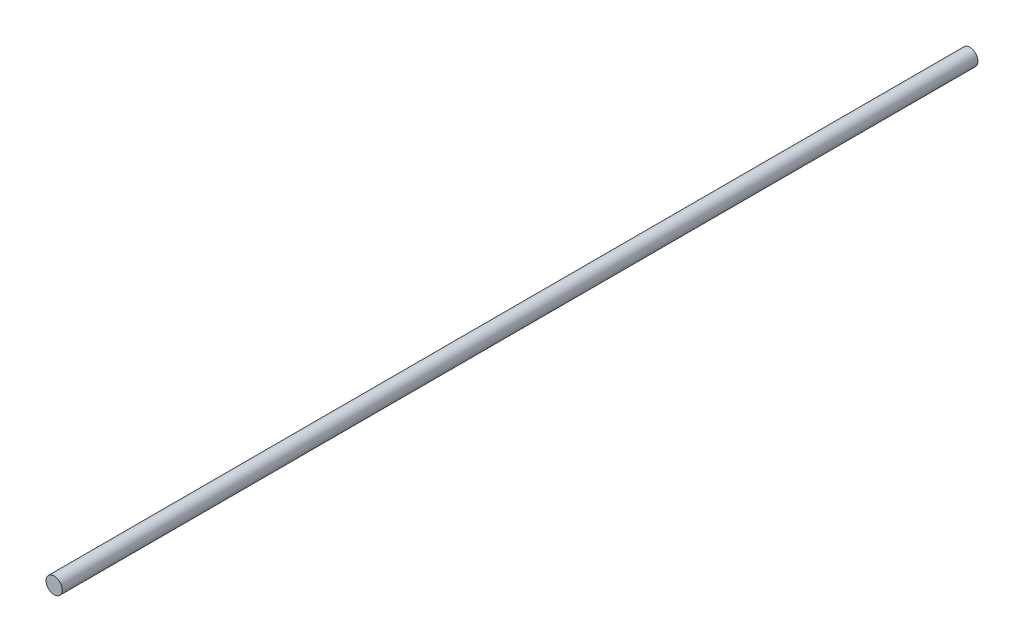
ISO-10303-21;
HEADER;
FILE_DESCRIPTION(('STEP AP214'),'2;1');
FILE_NAME('part.step','',(''),(''),'','','');
FILE_SCHEMA(('AUTOMOTIVE_DESIGN { 1 0 10303 214 1 1 1 1 }'));
ENDSEC;
DATA;
#1=APPLICATION_CONTEXT('core data for automotive mechanical design processes');
#2=APPLICATION_PROTOCOL_DEFINITION('international standard','automotive_design',2000,#1);
#3=PRODUCT_CONTEXT('',#1,'mechanical');
#4=PRODUCT('Part','Part','',(#3));
#5=PRODUCT_RELATED_PRODUCT_CATEGORY('part','',(#4));
#6=PRODUCT_DEFINITION_FORMATION('','',#4);
#7=PRODUCT_DEFINITION_CONTEXT('part definition',#1,'design');
#8=PRODUCT_DEFINITION('design','',#6,#7);
#9=PRODUCT_DEFINITION_SHAPE('','',#8);
#10=(LENGTH_UNIT() NAMED_UNIT(*) SI_UNIT(.MILLI.,.METRE.));
#11=(NAMED_UNIT(*) PLANE_ANGLE_UNIT() SI_UNIT($,.RADIAN.));
#12=(NAMED_UNIT(*) SI_UNIT($,.STERADIAN.) SOLID_ANGLE_UNIT());
#13=UNCERTAINTY_MEASURE_WITH_UNIT(LENGTH_MEASURE(1.E-05),#10,'distance_accuracy_value','');
#14=(GEOMETRIC_REPRESENTATION_CONTEXT(3) GLOBAL_UNCERTAINTY_ASSIGNED_CONTEXT((#13)) GLOBAL_UNIT_ASSIGNED_CONTEXT((#10,
#11,#12)) REPRESENTATION_CONTEXT('',''));
#15=CARTESIAN_POINT('',(0.,0.,0.));
#16=DIRECTION('',(0.,0.,1.));
#17=DIRECTION('',(1.,0.,0.));
#18=AXIS2_PLACEMENT_3D('',#15,#16,#17);
#19=CARTESIAN_POINT('',(-6.92426235031009,1.80200631984917,450.));
#20=DIRECTION('',(0.,0.,-1.));
#21=DIRECTION('',(-1.,0.,0.));
#22=AXIS2_PLACEMENT_3D('',#19,#20,#21);
#23=CYLINDRICAL_SURFACE('',#22,4.);
#24=CARTESIAN_POINT('',(-6.92426235031009,1.80200631984917,450.));
#25=DIRECTION('',(0.,0.,1.));
#26=DIRECTION('',(1.,0.,0.));
#27=AXIS2_PLACEMENT_3D('',#24,#25,#26);
#28=CIRCLE('',#27,4.);
#29=CARTESIAN_POINT('',(-2.92426235031009,1.80200631984917,450.));
#30=VERTEX_POINT('',#29);
#31=EDGE_CURVE('E10',#30,#30,#28,.T.);
#32=ORIENTED_EDGE('',*,*,#31,.F.);
#33=EDGE_LOOP('',(#32));
#34=FACE_BOUND('',#33,.T.);
#35=CARTESIAN_POINT('',(-6.92426235031009,1.80200631984917,0.));
#36=DIRECTION('',(0.,0.,1.));
#37=DIRECTION('',(1.,0.,0.));
#38=AXIS2_PLACEMENT_3D('',#35,#36,#37);
#39=CIRCLE('',#38,4.);
#40=CARTESIAN_POINT('',(-2.92426235031009,1.80200631984917,0.));
#41=VERTEX_POINT('',#40);
#42=EDGE_CURVE('E33',#41,#41,#39,.T.);
#43=ORIENTED_EDGE('',*,*,#42,.T.);
#44=EDGE_LOOP('',(#43));
#45=FACE_BOUND('',#44,.T.);
#46=ADVANCED_FACE('F30',(#34,#45),#23,.T.);
#47=CARTESIAN_POINT('',(-6.92426235031009,1.80200631984917,450.));
#48=DIRECTION('',(0.,0.,1.));
#49=DIRECTION('',(1.,0.,0.));
#50=AXIS2_PLACEMENT_3D('',#47,#48,#49);
#51=PLANE('',#50);
#52=ORIENTED_EDGE('',*,*,#31,.T.);
#53=EDGE_LOOP('',(#52));
#54=FACE_BOUND('',#53,.T.);
#55=ADVANCED_FACE('F45',(#54),#51,.T.);
#56=CARTESIAN_POINT('',(-6.92426235031009,1.80200631984917,0.));
#57=DIRECTION('',(0.,0.,1.));
#58=DIRECTION('',(1.,0.,0.));
#59=AXIS2_PLACEMENT_3D('',#56,#57,#58);
#60=PLANE('',#59);
#61=ORIENTED_EDGE('',*,*,#42,.F.);
#62=EDGE_LOOP('',(#61));
#63=FACE_BOUND('',#62,.T.);
#64=ADVANCED_FACE('F43',(#63),#60,.F.);
#65=CLOSED_SHELL('',(#46,#55,#64));
#66=MANIFOLD_SOLID_BREP('B2',#65);
#67=ADVANCED_BREP_SHAPE_REPRESENTATION('',(#18,#66),#14);
#68=SHAPE_DEFINITION_REPRESENTATION(#9,#67);
ENDSEC;
END-ISO-10303-21;
